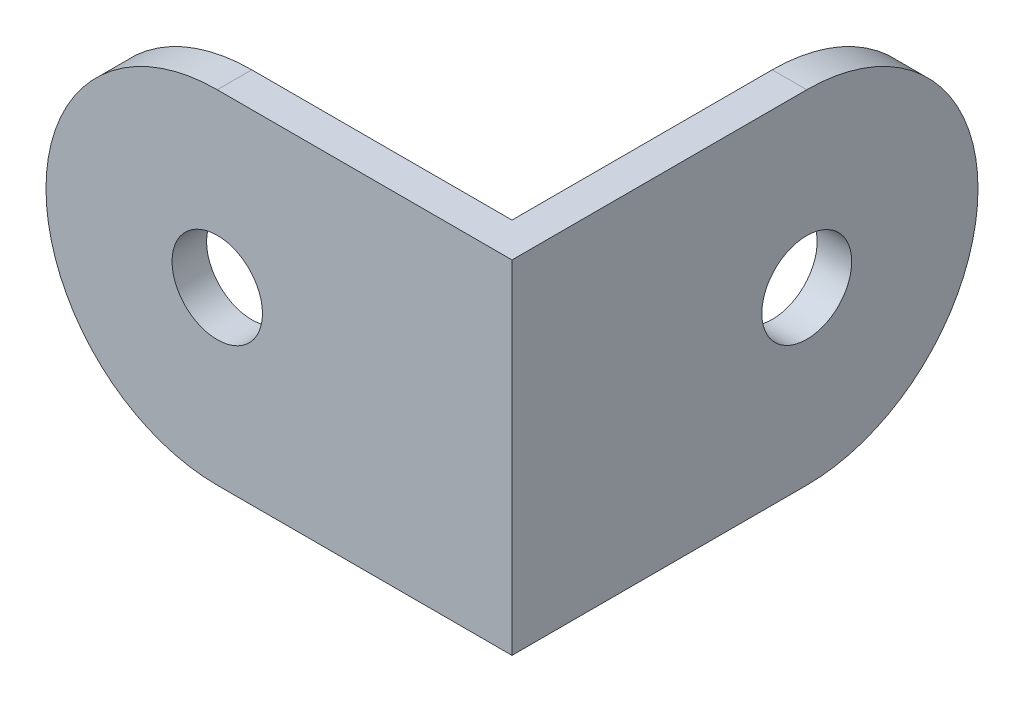
ISO-10303-21;
HEADER;
FILE_DESCRIPTION(('STEP AP214'),'2;1');
FILE_NAME('part.step','',(''),(''),'','','');
FILE_SCHEMA(('AUTOMOTIVE_DESIGN { 1 0 10303 214 1 1 1 1 }'));
ENDSEC;
DATA;
#1=APPLICATION_CONTEXT('core data for automotive mechanical design processes');
#2=APPLICATION_PROTOCOL_DEFINITION('international standard','automotive_design',2000,#1);
#3=PRODUCT_CONTEXT('',#1,'mechanical');
#4=PRODUCT('Part','Part','',(#3));
#5=PRODUCT_RELATED_PRODUCT_CATEGORY('part','',(#4));
#6=PRODUCT_DEFINITION_FORMATION('','',#4);
#7=PRODUCT_DEFINITION_CONTEXT('part definition',#1,'design');
#8=PRODUCT_DEFINITION('design','',#6,#7);
#9=PRODUCT_DEFINITION_SHAPE('','',#8);
#10=(LENGTH_UNIT() NAMED_UNIT(*) SI_UNIT(.MILLI.,.METRE.));
#11=(NAMED_UNIT(*) PLANE_ANGLE_UNIT() SI_UNIT($,.RADIAN.));
#12=(NAMED_UNIT(*) SI_UNIT($,.STERADIAN.) SOLID_ANGLE_UNIT());
#13=UNCERTAINTY_MEASURE_WITH_UNIT(LENGTH_MEASURE(1.E-05),#10,'distance_accuracy_value','');
#14=(GEOMETRIC_REPRESENTATION_CONTEXT(3) GLOBAL_UNCERTAINTY_ASSIGNED_CONTEXT((#13)) GLOBAL_UNIT_ASSIGNED_CONTEXT((#10,
#11,#12)) REPRESENTATION_CONTEXT('',''));
#15=CARTESIAN_POINT('',(0.,0.,0.));
#16=DIRECTION('',(0.,0.,1.));
#17=DIRECTION('',(1.,0.,0.));
#18=AXIS2_PLACEMENT_3D('',#15,#16,#17);
#19=CARTESIAN_POINT('',(-12.0625,7.9375,1.6));
#20=DIRECTION('',(0.,0.,-1.));
#21=DIRECTION('',(-1.,0.,0.));
#22=AXIS2_PLACEMENT_3D('',#19,#20,#21);
#23=CYLINDRICAL_SURFACE('',#22,7.9375);
#24=DIRECTION('',(0.,0.,-1.));
#25=VECTOR('',#24,1.);
#26=CARTESIAN_POINT('',(-12.0625,0.,0.));
#27=LINE('',#26,#25);
#28=CARTESIAN_POINT('',(-12.0625,0.,1.6));
#29=VERTEX_POINT('',#28);
#30=CARTESIAN_POINT('',(-12.0625,0.,0.));
#31=VERTEX_POINT('',#30);
#32=EDGE_CURVE('E135',#29,#31,#27,.T.);
#33=ORIENTED_EDGE('',*,*,#32,.F.);
#34=CARTESIAN_POINT('',(-12.0625,7.9375,1.6));
#35=DIRECTION('',(0.,0.,1.));
#36=DIRECTION('',(1.,0.,0.));
#37=AXIS2_PLACEMENT_3D('',#34,#35,#36);
#38=CIRCLE('',#37,7.9375);
#39=CARTESIAN_POINT('',(-12.0625,15.875,1.6));
#40=VERTEX_POINT('',#39);
#41=EDGE_CURVE('E44',#40,#29,#38,.T.);
#42=ORIENTED_EDGE('',*,*,#41,.F.);
#43=DIRECTION('',(0.,0.,1.));
#44=VECTOR('',#43,1.);
#45=CARTESIAN_POINT('',(-12.0625,15.875,1.6));
#46=LINE('',#45,#44);
#47=CARTESIAN_POINT('',(-12.0625,15.875,0.));
#48=VERTEX_POINT('',#47);
#49=EDGE_CURVE('E111',#48,#40,#46,.T.);
#50=ORIENTED_EDGE('',*,*,#49,.F.);
#51=CARTESIAN_POINT('',(-12.0625,7.9375,0.));
#52=DIRECTION('',(0.,0.,1.));
#53=DIRECTION('',(1.,0.,0.));
#54=AXIS2_PLACEMENT_3D('',#51,#52,#53);
#55=CIRCLE('',#54,7.9375);
#56=EDGE_CURVE('E11',#31,#48,#55,.F.);
#57=ORIENTED_EDGE('',*,*,#56,.F.);
#58=EDGE_LOOP('',(#33,#42,#50,#57));
#59=FACE_BOUND('',#58,.T.);
#60=ADVANCED_FACE('F35',(#59),#23,.T.);
#61=CARTESIAN_POINT('',(1.6,7.9375,-12.0625));
#62=DIRECTION('',(1.,0.,0.));
#63=DIRECTION('',(0.,0.,-1.));
#64=AXIS2_PLACEMENT_3D('',#61,#62,#63);
#65=CYLINDRICAL_SURFACE('',#64,7.9375);
#66=DIRECTION('',(-1.,0.,0.));
#67=VECTOR('',#66,1.);
#68=CARTESIAN_POINT('',(1.6,15.875,-12.0625));
#69=LINE('',#68,#67);
#70=CARTESIAN_POINT('',(1.6,15.875,-12.0625));
#71=VERTEX_POINT('',#70);
#72=CARTESIAN_POINT('',(0.,15.875,-12.0625));
#73=VERTEX_POINT('',#72);
#74=EDGE_CURVE('E106',#71,#73,#69,.T.);
#75=ORIENTED_EDGE('',*,*,#74,.F.);
#76=CARTESIAN_POINT('',(1.6,7.9375,-12.0625));
#77=DIRECTION('',(1.,0.,0.));
#78=DIRECTION('',(0.,0.,-1.));
#79=AXIS2_PLACEMENT_3D('',#76,#77,#78);
#80=CIRCLE('',#79,7.9375);
#81=CARTESIAN_POINT('',(1.6,0.,-12.0625));
#82=VERTEX_POINT('',#81);
#83=EDGE_CURVE('E93',#82,#71,#80,.T.);
#84=ORIENTED_EDGE('',*,*,#83,.F.);
#85=DIRECTION('',(1.,0.,0.));
#86=VECTOR('',#85,1.);
#87=CARTESIAN_POINT('',(0.,0.,-12.0625));
#88=LINE('',#87,#86);
#89=CARTESIAN_POINT('',(0.,0.,-12.0625));
#90=VERTEX_POINT('',#89);
#91=EDGE_CURVE('E129',#90,#82,#88,.T.);
#92=ORIENTED_EDGE('',*,*,#91,.F.);
#93=CARTESIAN_POINT('',(0.,7.9375,-12.0625));
#94=DIRECTION('',(1.,0.,0.));
#95=DIRECTION('',(0.,0.,-1.));
#96=AXIS2_PLACEMENT_3D('',#93,#94,#95);
#97=CIRCLE('',#96,7.9375);
#98=EDGE_CURVE('E133',#73,#90,#97,.F.);
#99=ORIENTED_EDGE('',*,*,#98,.F.);
#100=EDGE_LOOP('',(#75,#84,#92,#99));
#101=FACE_BOUND('',#100,.T.);
#102=ADVANCED_FACE('F145',(#101),#65,.T.);
#103=CARTESIAN_POINT('',(0.,15.875,0.));
#104=DIRECTION('',(0.,0.,1.));
#105=DIRECTION('',(1.,0.,0.));
#106=AXIS2_PLACEMENT_3D('',#103,#104,#105);
#107=PLANE('',#106);
#108=CARTESIAN_POINT('',(-12.0625,7.9375,0.));
#109=DIRECTION('',(0.,0.,-1.));
#110=DIRECTION('',(-1.,0.,0.));
#111=AXIS2_PLACEMENT_3D('',#108,#109,#110);
#112=CIRCLE('',#111,2.0955);
#113=CARTESIAN_POINT('',(-14.158,7.9375,0.));
#114=VERTEX_POINT('',#113);
#115=EDGE_CURVE('E245',#114,#114,#112,.T.);
#116=ORIENTED_EDGE('',*,*,#115,.F.);
#117=EDGE_LOOP('',(#116));
#118=FACE_BOUND('',#117,.T.);
#119=DIRECTION('',(-1.,0.,0.));
#120=VECTOR('',#119,1.);
#121=CARTESIAN_POINT('',(0.,0.,0.));
#122=LINE('',#121,#120);
#123=CARTESIAN_POINT('',(0.,0.,0.));
#124=VERTEX_POINT('',#123);
#125=EDGE_CURVE('E119',#124,#31,#122,.T.);
#126=ORIENTED_EDGE('',*,*,#125,.T.);
#127=ORIENTED_EDGE('',*,*,#56,.T.);
#128=DIRECTION('',(-1.,0.,0.));
#129=VECTOR('',#128,1.);
#130=CARTESIAN_POINT('',(0.,15.875,0.));
#131=LINE('',#130,#129);
#132=CARTESIAN_POINT('',(0.,15.875,0.));
#133=VERTEX_POINT('',#132);
#134=EDGE_CURVE('E112',#133,#48,#131,.T.);
#135=ORIENTED_EDGE('',*,*,#134,.F.);
#136=DIRECTION('',(0.,-1.,0.));
#137=VECTOR('',#136,1.);
#138=CARTESIAN_POINT('',(0.,15.875,0.));
#139=LINE('',#138,#137);
#140=EDGE_CURVE('E107',#133,#124,#139,.T.);
#141=ORIENTED_EDGE('',*,*,#140,.T.);
#142=EDGE_LOOP('',(#126,#127,#135,#141));
#143=FACE_BOUND('',#142,.T.);
#144=ADVANCED_FACE('F150',(#118,#143),#107,.F.);
#145=CARTESIAN_POINT('',(0.,15.875,1.6));
#146=DIRECTION('',(0.,0.,1.));
#147=DIRECTION('',(1.,0.,0.));
#148=AXIS2_PLACEMENT_3D('',#145,#146,#147);
#149=PLANE('',#148);
#150=CARTESIAN_POINT('',(-12.0625,7.9375,1.6));
#151=DIRECTION('',(0.,0.,1.));
#152=DIRECTION('',(1.,0.,0.));
#153=AXIS2_PLACEMENT_3D('',#150,#151,#152);
#154=CIRCLE('',#153,2.0955);
#155=CARTESIAN_POINT('',(-9.967,7.9375,1.6));
#156=VERTEX_POINT('',#155);
#157=EDGE_CURVE('E39',#156,#156,#154,.T.);
#158=ORIENTED_EDGE('',*,*,#157,.F.);
#159=EDGE_LOOP('',(#158));
#160=FACE_BOUND('',#159,.T.);
#161=DIRECTION('',(1.,0.,0.));
#162=VECTOR('',#161,1.);
#163=CARTESIAN_POINT('',(0.,15.875,1.6));
#164=LINE('',#163,#162);
#165=CARTESIAN_POINT('',(1.6,15.875,1.6));
#166=VERTEX_POINT('',#165);
#167=EDGE_CURVE('E99',#166,#40,#164,.F.);
#168=ORIENTED_EDGE('',*,*,#167,.T.);
#169=ORIENTED_EDGE('',*,*,#41,.T.);
#170=DIRECTION('',(1.,0.,0.));
#171=VECTOR('',#170,1.);
#172=CARTESIAN_POINT('',(0.,0.,1.6));
#173=LINE('',#172,#171);
#174=CARTESIAN_POINT('',(1.6,0.,1.6));
#175=VERTEX_POINT('',#174);
#176=EDGE_CURVE('E105',#175,#29,#173,.F.);
#177=ORIENTED_EDGE('',*,*,#176,.F.);
#178=DIRECTION('',(0.,-1.,0.));
#179=VECTOR('',#178,1.);
#180=CARTESIAN_POINT('',(1.6,15.875,1.6));
#181=LINE('',#180,#179);
#182=EDGE_CURVE('E91',#166,#175,#181,.T.);
#183=ORIENTED_EDGE('',*,*,#182,.F.);
#184=EDGE_LOOP('',(#168,#169,#177,#183));
#185=FACE_BOUND('',#184,.T.);
#186=ADVANCED_FACE('F103',(#160,#185),#149,.T.);
#187=CARTESIAN_POINT('',(1.6,15.875,-20.));
#188=DIRECTION('',(1.,0.,0.));
#189=DIRECTION('',(0.,0.,-1.));
#190=AXIS2_PLACEMENT_3D('',#187,#188,#189);
#191=PLANE('',#190);
#192=CARTESIAN_POINT('',(1.6,7.9375,-12.0625));
#193=DIRECTION('',(1.,0.,0.));
#194=DIRECTION('',(0.,0.,-1.));
#195=AXIS2_PLACEMENT_3D('',#192,#193,#194);
#196=CIRCLE('',#195,2.0825);
#197=CARTESIAN_POINT('',(1.6,7.9375,-14.145));
#198=VERTEX_POINT('',#197);
#199=EDGE_CURVE('E121',#198,#198,#196,.T.);
#200=ORIENTED_EDGE('',*,*,#199,.F.);
#201=EDGE_LOOP('',(#200));
#202=FACE_BOUND('',#201,.T.);
#203=DIRECTION('',(0.,0.,1.));
#204=VECTOR('',#203,1.);
#205=CARTESIAN_POINT('',(1.6,0.,-20.));
#206=LINE('',#205,#204);
#207=EDGE_CURVE('E123',#82,#175,#206,.T.);
#208=ORIENTED_EDGE('',*,*,#207,.F.);
#209=ORIENTED_EDGE('',*,*,#83,.T.);
#210=DIRECTION('',(0.,0.,1.));
#211=VECTOR('',#210,1.);
#212=CARTESIAN_POINT('',(1.6,15.875,-20.));
#213=LINE('',#212,#211);
#214=EDGE_CURVE('E87',#71,#166,#213,.T.);
#215=ORIENTED_EDGE('',*,*,#214,.T.);
#216=ORIENTED_EDGE('',*,*,#182,.T.);
#217=EDGE_LOOP('',(#208,#209,#215,#216));
#218=FACE_BOUND('',#217,.T.);
#219=ADVANCED_FACE('F90',(#202,#218),#191,.T.);
#220=CARTESIAN_POINT('',(0.,15.875,-20.));
#221=DIRECTION('',(1.,0.,0.));
#222=DIRECTION('',(0.,0.,-1.));
#223=AXIS2_PLACEMENT_3D('',#220,#221,#222);
#224=PLANE('',#223);
#225=CARTESIAN_POINT('',(0.,7.9375,-12.0625));
#226=DIRECTION('',(-1.,0.,0.));
#227=DIRECTION('',(0.,0.,1.));
#228=AXIS2_PLACEMENT_3D('',#225,#226,#227);
#229=CIRCLE('',#228,2.0825);
#230=CARTESIAN_POINT('',(0.,7.9375,-9.98));
#231=VERTEX_POINT('',#230);
#232=EDGE_CURVE('E240',#231,#231,#229,.T.);
#233=ORIENTED_EDGE('',*,*,#232,.F.);
#234=EDGE_LOOP('',(#233));
#235=FACE_BOUND('',#234,.T.);
#236=DIRECTION('',(0.,0.,1.));
#237=VECTOR('',#236,1.);
#238=CARTESIAN_POINT('',(0.,15.875,-20.));
#239=LINE('',#238,#237);
#240=EDGE_CURVE('E98',#73,#133,#239,.T.);
#241=ORIENTED_EDGE('',*,*,#240,.F.);
#242=ORIENTED_EDGE('',*,*,#98,.T.);
#243=DIRECTION('',(0.,0.,1.));
#244=VECTOR('',#243,1.);
#245=CARTESIAN_POINT('',(0.,0.,-20.));
#246=LINE('',#245,#244);
#247=EDGE_CURVE('E114',#90,#124,#246,.T.);
#248=ORIENTED_EDGE('',*,*,#247,.T.);
#249=ORIENTED_EDGE('',*,*,#140,.F.);
#250=EDGE_LOOP('',(#241,#242,#248,#249));
#251=FACE_BOUND('',#250,.T.);
#252=ADVANCED_FACE('F149',(#235,#251),#224,.F.);
#253=CARTESIAN_POINT('',(0.,15.875,0.));
#254=DIRECTION('',(0.,-1.,0.));
#255=DIRECTION('',(-1.,0.,0.));
#256=AXIS2_PLACEMENT_3D('',#253,#254,#255);
#257=PLANE('',#256);
#258=ORIENTED_EDGE('',*,*,#134,.T.);
#259=ORIENTED_EDGE('',*,*,#49,.T.);
#260=ORIENTED_EDGE('',*,*,#167,.F.);
#261=ORIENTED_EDGE('',*,*,#214,.F.);
#262=ORIENTED_EDGE('',*,*,#74,.T.);
#263=ORIENTED_EDGE('',*,*,#240,.T.);
#264=EDGE_LOOP('',(#258,#259,#260,#261,#262,#263));
#265=FACE_BOUND('',#264,.T.);
#266=ADVANCED_FACE('F110',(#265),#257,.F.);
#267=CARTESIAN_POINT('',(0.,0.,0.));
#268=DIRECTION('',(0.,-1.,0.));
#269=DIRECTION('',(-1.,0.,0.));
#270=AXIS2_PLACEMENT_3D('',#267,#268,#269);
#271=PLANE('',#270);
#272=ORIENTED_EDGE('',*,*,#176,.T.);
#273=ORIENTED_EDGE('',*,*,#32,.T.);
#274=ORIENTED_EDGE('',*,*,#125,.F.);
#275=ORIENTED_EDGE('',*,*,#247,.F.);
#276=ORIENTED_EDGE('',*,*,#91,.T.);
#277=ORIENTED_EDGE('',*,*,#207,.T.);
#278=EDGE_LOOP('',(#272,#273,#274,#275,#276,#277));
#279=FACE_BOUND('',#278,.T.);
#280=ADVANCED_FACE('F141',(#279),#271,.T.);
#281=CARTESIAN_POINT('',(10.,7.9375,-12.0625));
#282=DIRECTION('',(-1.,0.,0.));
#283=DIRECTION('',(0.,0.,1.));
#284=AXIS2_PLACEMENT_3D('',#281,#282,#283);
#285=CYLINDRICAL_SURFACE('',#284,2.0825);
#286=ORIENTED_EDGE('',*,*,#199,.T.);
#287=EDGE_LOOP('',(#286));
#288=FACE_BOUND('',#287,.T.);
#289=ORIENTED_EDGE('',*,*,#232,.T.);
#290=EDGE_LOOP('',(#289));
#291=FACE_BOUND('',#290,.T.);
#292=ADVANCED_FACE('F181',(#288,#291),#285,.F.);
#293=CARTESIAN_POINT('',(-12.0625,7.9375,10.));
#294=DIRECTION('',(0.,0.,-1.));
#295=DIRECTION('',(-1.,0.,0.));
#296=AXIS2_PLACEMENT_3D('',#293,#294,#295);
#297=CYLINDRICAL_SURFACE('',#296,2.0955);
#298=ORIENTED_EDGE('',*,*,#157,.T.);
#299=EDGE_LOOP('',(#298));
#300=FACE_BOUND('',#299,.T.);
#301=ORIENTED_EDGE('',*,*,#115,.T.);
#302=EDGE_LOOP('',(#301));
#303=FACE_BOUND('',#302,.T.);
#304=ADVANCED_FACE('F187',(#300,#303),#297,.F.);
#305=CLOSED_SHELL('',(#60,#102,#144,#186,#219,#252,#266,#280,#292,#304));
#306=MANIFOLD_SOLID_BREP('B2',#305);
#307=ADVANCED_BREP_SHAPE_REPRESENTATION('',(#18,#306),#14);
#308=SHAPE_DEFINITION_REPRESENTATION(#9,#307);
ENDSEC;
END-ISO-10303-21;
